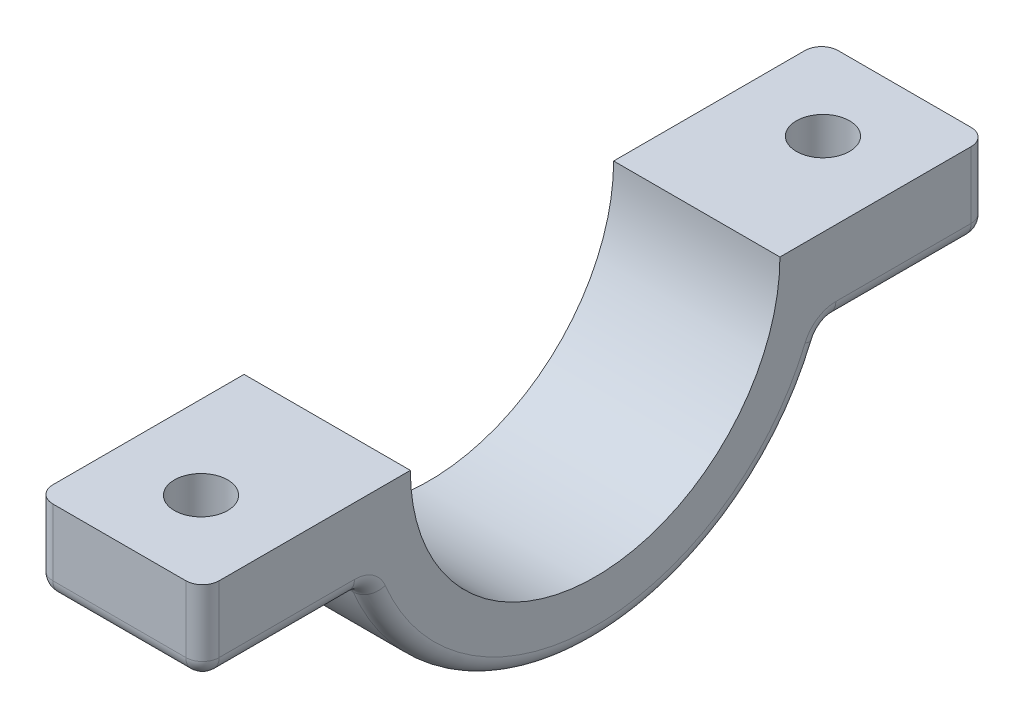
ISO-10303-21;
HEADER;
FILE_DESCRIPTION(('STEP AP214'),'2;1');
FILE_NAME('part.step','',(''),(''),'','','');
FILE_SCHEMA(('AUTOMOTIVE_DESIGN { 1 0 10303 214 1 1 1 1 }'));
ENDSEC;
DATA;
#1=APPLICATION_CONTEXT('core data for automotive mechanical design processes');
#2=APPLICATION_PROTOCOL_DEFINITION('international standard','automotive_design',2000,#1);
#3=PRODUCT_CONTEXT('',#1,'mechanical');
#4=PRODUCT('Part','Part','',(#3));
#5=PRODUCT_RELATED_PRODUCT_CATEGORY('part','',(#4));
#6=PRODUCT_DEFINITION_FORMATION('','',#4);
#7=PRODUCT_DEFINITION_CONTEXT('part definition',#1,'design');
#8=PRODUCT_DEFINITION('design','',#6,#7);
#9=PRODUCT_DEFINITION_SHAPE('','',#8);
#10=(LENGTH_UNIT() NAMED_UNIT(*) SI_UNIT(.MILLI.,.METRE.));
#11=(NAMED_UNIT(*) PLANE_ANGLE_UNIT() SI_UNIT($,.RADIAN.));
#12=(NAMED_UNIT(*) SI_UNIT($,.STERADIAN.) SOLID_ANGLE_UNIT());
#13=UNCERTAINTY_MEASURE_WITH_UNIT(LENGTH_MEASURE(1.E-05),#10,'distance_accuracy_value','');
#14=(GEOMETRIC_REPRESENTATION_CONTEXT(3) GLOBAL_UNCERTAINTY_ASSIGNED_CONTEXT((#13)) GLOBAL_UNIT_ASSIGNED_CONTEXT((#10,
#11,#12)) REPRESENTATION_CONTEXT('',''));
#15=CARTESIAN_POINT('',(0.,0.,0.));
#16=DIRECTION('',(0.,0.,1.));
#17=DIRECTION('',(1.,0.,0.));
#18=AXIS2_PLACEMENT_3D('',#15,#16,#17);
#19=CARTESIAN_POINT('',(10.,0.,0.));
#20=DIRECTION('',(-1.,0.,0.));
#21=DIRECTION('',(0.,0.,1.));
#22=AXIS2_PLACEMENT_3D('',#19,#20,#21);
#23=CYLINDRICAL_SURFACE('',#22,14.6684237820565);
#24=CARTESIAN_POINT('',(0.999999999999999,0.,0.));
#25=DIRECTION('',(1.,0.,0.));
#26=DIRECTION('',(0.,0.,-1.));
#27=AXIS2_PLACEMENT_3D('',#24,#25,#26);
#28=CIRCLE('',#27,14.6684237820565);
#29=CARTESIAN_POINT('',(0.999999999999999,-5.61706422525594,13.5503227171662));
#30=VERTEX_POINT('',#29);
#31=CARTESIAN_POINT('',(0.999999999999999,-5.61706422525594,-13.5503227171662));
#32=VERTEX_POINT('',#31);
#33=EDGE_CURVE('E265',#30,#32,#28,.T.);
#34=ORIENTED_EDGE('',*,*,#33,.T.);
#35=DIRECTION('',(-1.,0.,0.));
#36=VECTOR('',#35,1.);
#37=CARTESIAN_POINT('',(10.,-5.61706422525594,-13.5503227171662));
#38=LINE('',#37,#36);
#39=CARTESIAN_POINT('',(9.,-5.61706422525594,-13.5503227171662));
#40=VERTEX_POINT('',#39);
#41=EDGE_CURVE('E270',#32,#40,#38,.F.);
#42=ORIENTED_EDGE('',*,*,#41,.T.);
#43=CARTESIAN_POINT('',(9.,0.,0.));
#44=DIRECTION('',(1.,0.,0.));
#45=DIRECTION('',(0.,0.,-1.));
#46=AXIS2_PLACEMENT_3D('',#43,#44,#45);
#47=CIRCLE('',#46,14.6684237820565);
#48=CARTESIAN_POINT('',(9.,-5.61706422525594,13.5503227171662));
#49=VERTEX_POINT('',#48);
#50=EDGE_CURVE('E267',#40,#49,#47,.F.);
#51=ORIENTED_EDGE('',*,*,#50,.T.);
#52=DIRECTION('',(-1.,0.,0.));
#53=VECTOR('',#52,1.);
#54=CARTESIAN_POINT('',(10.,-5.61706422525594,13.5503227171662));
#55=LINE('',#54,#53);
#56=EDGE_CURVE('E263',#49,#30,#55,.T.);
#57=ORIENTED_EDGE('',*,*,#56,.T.);
#58=EDGE_LOOP('',(#34,#42,#51,#57));
#59=FACE_BOUND('',#58,.T.);
#60=ADVANCED_FACE('F41',(#59),#23,.T.);
#61=CARTESIAN_POINT('',(10.,-5.,-13.7899476521849));
#62=DIRECTION('',(0.,1.,0.));
#63=DIRECTION('',(0.,0.,1.));
#64=AXIS2_PLACEMENT_3D('',#61,#62,#63);
#65=PLANE('',#64);
#66=DIRECTION('',(0.,0.,-1.));
#67=VECTOR('',#66,1.);
#68=CARTESIAN_POINT('',(0.999999999999999,-5.,-13.7899476521849));
#69=LINE('',#68,#67);
#70=CARTESIAN_POINT('',(0.999999999999999,-5.,-14.4740976856629));
#71=VERTEX_POINT('',#70);
#72=CARTESIAN_POINT('',(0.999999999999999,-5.,-22.6125));
#73=VERTEX_POINT('',#72);
#74=EDGE_CURVE('E240',#71,#73,#69,.T.);
#75=ORIENTED_EDGE('',*,*,#74,.T.);
#76=DIRECTION('',(-1.,0.,0.));
#77=VECTOR('',#76,1.);
#78=CARTESIAN_POINT('',(10.,-5.,-22.6125));
#79=LINE('',#78,#77);
#80=CARTESIAN_POINT('',(9.,-5.,-22.6125));
#81=VERTEX_POINT('',#80);
#82=EDGE_CURVE('E245',#73,#81,#79,.F.);
#83=ORIENTED_EDGE('',*,*,#82,.T.);
#84=DIRECTION('',(0.,0.,-1.));
#85=VECTOR('',#84,1.);
#86=CARTESIAN_POINT('',(9.,-5.,-13.7899476521849));
#87=LINE('',#86,#85);
#88=CARTESIAN_POINT('',(9.,-5.,-14.4740976856629));
#89=VERTEX_POINT('',#88);
#90=EDGE_CURVE('E242',#81,#89,#87,.F.);
#91=ORIENTED_EDGE('',*,*,#90,.T.);
#92=DIRECTION('',(1.,0.,0.));
#93=VECTOR('',#92,1.);
#94=CARTESIAN_POINT('',(0.,-5.,-14.4740976856629));
#95=LINE('',#94,#93);
#96=EDGE_CURVE('E238',#89,#71,#95,.F.);
#97=ORIENTED_EDGE('',*,*,#96,.T.);
#98=EDGE_LOOP('',(#75,#83,#91,#97));
#99=FACE_BOUND('',#98,.T.);
#100=CARTESIAN_POINT('',(5.,-5.,-18.7012238260924));
#101=DIRECTION('',(0.,-1.,0.));
#102=DIRECTION('',(0.,0.,-1.));
#103=AXIS2_PLACEMENT_3D('',#100,#101,#102);
#104=CIRCLE('',#103,1.6);
#105=CARTESIAN_POINT('',(5.,-5.,-20.3012238260924));
#106=VERTEX_POINT('',#105);
#107=EDGE_CURVE('E363',#106,#106,#104,.F.);
#108=ORIENTED_EDGE('',*,*,#107,.T.);
#109=EDGE_LOOP('',(#108));
#110=FACE_BOUND('',#109,.T.);
#111=ADVANCED_FACE('F404',(#99,#110),#65,.F.);
#112=CARTESIAN_POINT('',(10.,0.,-23.6125));
#113=DIRECTION('',(0.,0.,1.));
#114=DIRECTION('',(1.,0.,0.));
#115=AXIS2_PLACEMENT_3D('',#112,#113,#114);
#116=PLANE('',#115);
#117=DIRECTION('',(-1.,0.,0.));
#118=VECTOR('',#117,1.);
#119=CARTESIAN_POINT('',(10.,0.,-23.6125));
#120=LINE('',#119,#118);
#121=CARTESIAN_POINT('',(9.,0.,-23.6125));
#122=VERTEX_POINT('',#121);
#123=CARTESIAN_POINT('',(0.999999999999999,0.,-23.6125));
#124=VERTEX_POINT('',#123);
#125=EDGE_CURVE('E201',#122,#124,#120,.T.);
#126=ORIENTED_EDGE('',*,*,#125,.F.);
#127=DIRECTION('',(0.,1.,0.));
#128=VECTOR('',#127,1.);
#129=CARTESIAN_POINT('',(9.,-5.,-23.6125));
#130=LINE('',#129,#128);
#131=CARTESIAN_POINT('',(9.,-4.,-23.6125));
#132=VERTEX_POINT('',#131);
#133=EDGE_CURVE('E290',#122,#132,#130,.F.);
#134=ORIENTED_EDGE('',*,*,#133,.T.);
#135=DIRECTION('',(-1.,0.,0.));
#136=VECTOR('',#135,1.);
#137=CARTESIAN_POINT('',(10.,-4.,-23.6125));
#138=LINE('',#137,#136);
#139=CARTESIAN_POINT('',(0.999999999999999,-4.,-23.6125));
#140=VERTEX_POINT('',#139);
#141=EDGE_CURVE('E286',#132,#140,#138,.T.);
#142=ORIENTED_EDGE('',*,*,#141,.T.);
#143=DIRECTION('',(0.,1.,0.));
#144=VECTOR('',#143,1.);
#145=CARTESIAN_POINT('',(0.999999999999999,0.,-23.6125));
#146=LINE('',#145,#144);
#147=EDGE_CURVE('E288',#140,#124,#146,.T.);
#148=ORIENTED_EDGE('',*,*,#147,.T.);
#149=EDGE_LOOP('',(#126,#134,#142,#148));
#150=FACE_BOUND('',#149,.T.);
#151=ADVANCED_FACE('F411',(#150),#116,.F.);
#152=CARTESIAN_POINT('',(10.,0.,-11.1125));
#153=DIRECTION('',(0.,-1.,0.));
#154=DIRECTION('',(0.,0.,-1.));
#155=AXIS2_PLACEMENT_3D('',#152,#153,#154);
#156=PLANE('',#155);
#157=CARTESIAN_POINT('',(5.,0.,-18.7012238260924));
#158=DIRECTION('',(0.,-1.,0.));
#159=DIRECTION('',(0.,0.,-1.));
#160=AXIS2_PLACEMENT_3D('',#157,#158,#159);
#161=CIRCLE('',#160,1.6);
#162=CARTESIAN_POINT('',(5.,0.,-20.3012238260924));
#163=VERTEX_POINT('',#162);
#164=EDGE_CURVE('E368',#163,#163,#161,.F.);
#165=ORIENTED_EDGE('',*,*,#164,.F.);
#166=EDGE_LOOP('',(#165));
#167=FACE_BOUND('',#166,.T.);
#168=DIRECTION('',(0.,0.,1.));
#169=VECTOR('',#168,1.);
#170=CARTESIAN_POINT('',(10.,0.,-11.1125));
#171=LINE('',#170,#169);
#172=CARTESIAN_POINT('',(10.,0.,-22.6125));
#173=VERTEX_POINT('',#172);
#174=CARTESIAN_POINT('',(10.,0.,-11.1125));
#175=VERTEX_POINT('',#174);
#176=EDGE_CURVE('E180',#173,#175,#171,.T.);
#177=ORIENTED_EDGE('',*,*,#176,.F.);
#178=CARTESIAN_POINT('',(9.,0.,-22.6125));
#179=DIRECTION('',(0.,-1.,0.));
#180=DIRECTION('',(0.,0.,-1.));
#181=AXIS2_PLACEMENT_3D('',#178,#179,#180);
#182=CIRCLE('',#181,1.);
#183=EDGE_CURVE('E284',#173,#122,#182,.F.);
#184=ORIENTED_EDGE('',*,*,#183,.T.);
#185=ORIENTED_EDGE('',*,*,#125,.T.);
#186=CARTESIAN_POINT('',(0.999999999999999,0.,-22.6125));
#187=DIRECTION('',(0.,-1.,0.));
#188=DIRECTION('',(0.,0.,-1.));
#189=AXIS2_PLACEMENT_3D('',#186,#187,#188);
#190=CIRCLE('',#189,1.);
#191=CARTESIAN_POINT('',(0.,0.,-22.6125));
#192=VERTEX_POINT('',#191);
#193=EDGE_CURVE('E282',#124,#192,#190,.F.);
#194=ORIENTED_EDGE('',*,*,#193,.T.);
#195=DIRECTION('',(0.,0.,1.));
#196=VECTOR('',#195,1.);
#197=CARTESIAN_POINT('',(0.,0.,-11.1125));
#198=LINE('',#197,#196);
#199=CARTESIAN_POINT('',(0.,0.,-11.1125));
#200=VERTEX_POINT('',#199);
#201=EDGE_CURVE('E198',#192,#200,#198,.T.);
#202=ORIENTED_EDGE('',*,*,#201,.T.);
#203=DIRECTION('',(-1.,0.,0.));
#204=VECTOR('',#203,1.);
#205=CARTESIAN_POINT('',(10.,0.,-11.1125));
#206=LINE('',#205,#204);
#207=EDGE_CURVE('E195',#175,#200,#206,.T.);
#208=ORIENTED_EDGE('',*,*,#207,.F.);
#209=EDGE_LOOP('',(#177,#184,#185,#194,#202,#208));
#210=FACE_BOUND('',#209,.T.);
#211=ADVANCED_FACE('F196',(#167,#210),#156,.F.);
#212=CARTESIAN_POINT('',(10.,0.,0.));
#213=DIRECTION('',(-1.,0.,0.));
#214=DIRECTION('',(0.,0.,1.));
#215=AXIS2_PLACEMENT_3D('',#212,#213,#214);
#216=CYLINDRICAL_SURFACE('',#215,11.1125);
#217=CARTESIAN_POINT('',(0.,0.,0.));
#218=DIRECTION('',(-1.,0.,0.));
#219=DIRECTION('',(0.,0.,-1.));
#220=AXIS2_PLACEMENT_3D('',#217,#218,#219);
#221=CIRCLE('',#220,11.1125);
#222=CARTESIAN_POINT('',(0.,0.,11.1125));
#223=VERTEX_POINT('',#222);
#224=EDGE_CURVE('E214',#200,#223,#221,.T.);
#225=ORIENTED_EDGE('',*,*,#224,.T.);
#226=DIRECTION('',(-1.,0.,0.));
#227=VECTOR('',#226,1.);
#228=CARTESIAN_POINT('',(10.,0.,11.1125));
#229=LINE('',#228,#227);
#230=CARTESIAN_POINT('',(10.,0.,11.1125));
#231=VERTEX_POINT('',#230);
#232=EDGE_CURVE('E202',#231,#223,#229,.T.);
#233=ORIENTED_EDGE('',*,*,#232,.F.);
#234=CARTESIAN_POINT('',(10.,0.,0.));
#235=DIRECTION('',(-1.,0.,0.));
#236=DIRECTION('',(0.,0.,-1.));
#237=AXIS2_PLACEMENT_3D('',#234,#235,#236);
#238=CIRCLE('',#237,11.1125);
#239=EDGE_CURVE('E186',#175,#231,#238,.T.);
#240=ORIENTED_EDGE('',*,*,#239,.F.);
#241=ORIENTED_EDGE('',*,*,#207,.T.);
#242=EDGE_LOOP('',(#225,#233,#240,#241));
#243=FACE_BOUND('',#242,.T.);
#244=ADVANCED_FACE('F204',(#243),#216,.F.);
#245=CARTESIAN_POINT('',(10.,0.,23.6125));
#246=DIRECTION('',(0.,-1.,0.));
#247=DIRECTION('',(0.,0.,-1.));
#248=AXIS2_PLACEMENT_3D('',#245,#246,#247);
#249=PLANE('',#248);
#250=CARTESIAN_POINT('',(5.,0.,18.7012238260924));
#251=DIRECTION('',(0.,-1.,0.));
#252=DIRECTION('',(0.,0.,-1.));
#253=AXIS2_PLACEMENT_3D('',#250,#251,#252);
#254=CIRCLE('',#253,1.6);
#255=CARTESIAN_POINT('',(5.,0.,17.1012238260924));
#256=VERTEX_POINT('',#255);
#257=EDGE_CURVE('E215',#256,#256,#254,.T.);
#258=ORIENTED_EDGE('',*,*,#257,.T.);
#259=EDGE_LOOP('',(#258));
#260=FACE_BOUND('',#259,.T.);
#261=DIRECTION('',(0.,0.,1.));
#262=VECTOR('',#261,1.);
#263=CARTESIAN_POINT('',(0.,0.,23.6125));
#264=LINE('',#263,#262);
#265=CARTESIAN_POINT('',(0.,0.,22.6125));
#266=VERTEX_POINT('',#265);
#267=EDGE_CURVE('E192',#223,#266,#264,.T.);
#268=ORIENTED_EDGE('',*,*,#267,.T.);
#269=CARTESIAN_POINT('',(0.999999999999999,0.,22.6125));
#270=DIRECTION('',(0.,-1.,0.));
#271=DIRECTION('',(0.,0.,-1.));
#272=AXIS2_PLACEMENT_3D('',#269,#270,#271);
#273=CIRCLE('',#272,1.);
#274=CARTESIAN_POINT('',(0.999999999999999,0.,23.6125));
#275=VERTEX_POINT('',#274);
#276=EDGE_CURVE('E280',#266,#275,#273,.F.);
#277=ORIENTED_EDGE('',*,*,#276,.T.);
#278=DIRECTION('',(-1.,0.,0.));
#279=VECTOR('',#278,1.);
#280=CARTESIAN_POINT('',(10.,0.,23.6125));
#281=LINE('',#280,#279);
#282=CARTESIAN_POINT('',(9.,0.,23.6125));
#283=VERTEX_POINT('',#282);
#284=EDGE_CURVE('E209',#283,#275,#281,.T.);
#285=ORIENTED_EDGE('',*,*,#284,.F.);
#286=CARTESIAN_POINT('',(9.,0.,22.6125));
#287=DIRECTION('',(0.,-1.,0.));
#288=DIRECTION('',(0.,0.,-1.));
#289=AXIS2_PLACEMENT_3D('',#286,#287,#288);
#290=CIRCLE('',#289,1.);
#291=CARTESIAN_POINT('',(10.,0.,22.6125));
#292=VERTEX_POINT('',#291);
#293=EDGE_CURVE('E278',#283,#292,#290,.F.);
#294=ORIENTED_EDGE('',*,*,#293,.T.);
#295=DIRECTION('',(0.,0.,1.));
#296=VECTOR('',#295,1.);
#297=CARTESIAN_POINT('',(10.,0.,23.6125));
#298=LINE('',#297,#296);
#299=EDGE_CURVE('E207',#231,#292,#298,.T.);
#300=ORIENTED_EDGE('',*,*,#299,.F.);
#301=ORIENTED_EDGE('',*,*,#232,.T.);
#302=EDGE_LOOP('',(#268,#277,#285,#294,#300,#301));
#303=FACE_BOUND('',#302,.T.);
#304=ADVANCED_FACE('F380',(#260,#303),#249,.F.);
#305=CARTESIAN_POINT('',(10.,0.,23.6125));
#306=DIRECTION('',(0.,0.,-1.));
#307=DIRECTION('',(-1.,0.,0.));
#308=AXIS2_PLACEMENT_3D('',#305,#306,#307);
#309=PLANE('',#308);
#310=ORIENTED_EDGE('',*,*,#284,.T.);
#311=DIRECTION('',(0.,-1.,0.));
#312=VECTOR('',#311,1.);
#313=CARTESIAN_POINT('',(0.999999999999999,0.,23.6125));
#314=LINE('',#313,#312);
#315=CARTESIAN_POINT('',(0.999999999999999,-4.,23.6125));
#316=VERTEX_POINT('',#315);
#317=EDGE_CURVE('E276',#275,#316,#314,.T.);
#318=ORIENTED_EDGE('',*,*,#317,.T.);
#319=DIRECTION('',(-1.,0.,0.));
#320=VECTOR('',#319,1.);
#321=CARTESIAN_POINT('',(10.,-4.,23.6125));
#322=LINE('',#321,#320);
#323=CARTESIAN_POINT('',(9.,-4.,23.6125));
#324=VERTEX_POINT('',#323);
#325=EDGE_CURVE('E272',#316,#324,#322,.F.);
#326=ORIENTED_EDGE('',*,*,#325,.T.);
#327=DIRECTION('',(0.,-1.,0.));
#328=VECTOR('',#327,1.);
#329=CARTESIAN_POINT('',(9.,0.,23.6125));
#330=LINE('',#329,#328);
#331=EDGE_CURVE('E274',#324,#283,#330,.F.);
#332=ORIENTED_EDGE('',*,*,#331,.T.);
#333=EDGE_LOOP('',(#310,#318,#326,#332));
#334=FACE_BOUND('',#333,.T.);
#335=ADVANCED_FACE('F393',(#334),#309,.F.);
#336=CARTESIAN_POINT('',(10.,-5.,23.6125));
#337=DIRECTION('',(0.,1.,0.));
#338=DIRECTION('',(0.,0.,1.));
#339=AXIS2_PLACEMENT_3D('',#336,#337,#338);
#340=PLANE('',#339);
#341=DIRECTION('',(0.,0.,-1.));
#342=VECTOR('',#341,1.);
#343=CARTESIAN_POINT('',(0.999999999999999,-5.,23.6125));
#344=LINE('',#343,#342);
#345=CARTESIAN_POINT('',(0.999999999999999,-5.,22.6125));
#346=VERTEX_POINT('',#345);
#347=CARTESIAN_POINT('',(0.999999999999999,-5.,14.4740976856629));
#348=VERTEX_POINT('',#347);
#349=EDGE_CURVE('E292',#346,#348,#344,.T.);
#350=ORIENTED_EDGE('',*,*,#349,.T.);
#351=DIRECTION('',(1.,0.,0.));
#352=VECTOR('',#351,1.);
#353=CARTESIAN_POINT('',(10.,-5.,14.4740976856629));
#354=LINE('',#353,#352);
#355=CARTESIAN_POINT('',(9.,-5.,14.4740976856629));
#356=VERTEX_POINT('',#355);
#357=EDGE_CURVE('E11',#348,#356,#354,.T.);
#358=ORIENTED_EDGE('',*,*,#357,.T.);
#359=DIRECTION('',(0.,0.,-1.));
#360=VECTOR('',#359,1.);
#361=CARTESIAN_POINT('',(9.,-5.,23.6125));
#362=LINE('',#361,#360);
#363=CARTESIAN_POINT('',(9.,-5.,22.6125));
#364=VERTEX_POINT('',#363);
#365=EDGE_CURVE('E50',#356,#364,#362,.F.);
#366=ORIENTED_EDGE('',*,*,#365,.T.);
#367=DIRECTION('',(-1.,0.,0.));
#368=VECTOR('',#367,1.);
#369=CARTESIAN_POINT('',(10.,-5.,22.6125));
#370=LINE('',#369,#368);
#371=EDGE_CURVE('E294',#364,#346,#370,.T.);
#372=ORIENTED_EDGE('',*,*,#371,.T.);
#373=EDGE_LOOP('',(#350,#358,#366,#372));
#374=FACE_BOUND('',#373,.T.);
#375=CARTESIAN_POINT('',(5.,-5.,18.7012238260924));
#376=DIRECTION('',(0.,-1.,0.));
#377=DIRECTION('',(0.,0.,-1.));
#378=AXIS2_PLACEMENT_3D('',#375,#376,#377);
#379=CIRCLE('',#378,1.6);
#380=CARTESIAN_POINT('',(5.,-5.,17.1012238260924));
#381=VERTEX_POINT('',#380);
#382=EDGE_CURVE('E372',#381,#381,#379,.T.);
#383=ORIENTED_EDGE('',*,*,#382,.F.);
#384=EDGE_LOOP('',(#383));
#385=FACE_BOUND('',#384,.T.);
#386=ADVANCED_FACE('F391',(#374,#385),#340,.F.);
#387=CARTESIAN_POINT('',(10.,0.,0.));
#388=DIRECTION('',(1.,0.,0.));
#389=DIRECTION('',(0.,0.,-1.));
#390=AXIS2_PLACEMENT_3D('',#387,#388,#389);
#391=PLANE('',#390);
#392=DIRECTION('',(0.,0.,-1.));
#393=VECTOR('',#392,1.);
#394=CARTESIAN_POINT('',(10.,-4.,-23.6125));
#395=LINE('',#394,#393);
#396=CARTESIAN_POINT('',(10.,-4.,-14.4740976856629));
#397=VERTEX_POINT('',#396);
#398=CARTESIAN_POINT('',(10.,-4.,-22.6125));
#399=VERTEX_POINT('',#398);
#400=EDGE_CURVE('E235',#397,#399,#395,.T.);
#401=ORIENTED_EDGE('',*,*,#400,.T.);
#402=DIRECTION('',(0.,1.,0.));
#403=VECTOR('',#402,1.);
#404=CARTESIAN_POINT('',(10.,0.,-22.6125));
#405=LINE('',#404,#403);
#406=EDGE_CURVE('E189',#399,#173,#405,.T.);
#407=ORIENTED_EDGE('',*,*,#406,.T.);
#408=ORIENTED_EDGE('',*,*,#176,.T.);
#409=ORIENTED_EDGE('',*,*,#239,.T.);
#410=ORIENTED_EDGE('',*,*,#299,.T.);
#411=DIRECTION('',(0.,-1.,0.));
#412=VECTOR('',#411,1.);
#413=CARTESIAN_POINT('',(10.,-5.,22.6125));
#414=LINE('',#413,#412);
#415=CARTESIAN_POINT('',(10.,-4.,22.6125));
#416=VERTEX_POINT('',#415);
#417=EDGE_CURVE('E228',#292,#416,#414,.T.);
#418=ORIENTED_EDGE('',*,*,#417,.T.);
#419=DIRECTION('',(0.,0.,-1.));
#420=VECTOR('',#419,1.);
#421=CARTESIAN_POINT('',(10.,-4.,13.7899476521849));
#422=LINE('',#421,#420);
#423=CARTESIAN_POINT('',(10.,-4.,14.4740976856629));
#424=VERTEX_POINT('',#423);
#425=EDGE_CURVE('E226',#416,#424,#422,.T.);
#426=ORIENTED_EDGE('',*,*,#425,.T.);
#427=CARTESIAN_POINT('',(10.,-6.,14.4740976856629));
#428=DIRECTION('',(1.,0.,0.));
#429=DIRECTION('',(0.,0.,-1.));
#430=AXIS2_PLACEMENT_3D('',#427,#428,#429);
#431=CIRCLE('',#430,2.);
#432=CARTESIAN_POINT('',(10.,-5.23412845051189,12.6265477486694));
#433=VERTEX_POINT('',#432);
#434=EDGE_CURVE('E224',#433,#424,#431,.T.);
#435=ORIENTED_EDGE('',*,*,#434,.F.);
#436=CARTESIAN_POINT('',(10.,0.,0.));
#437=DIRECTION('',(1.,0.,0.));
#438=DIRECTION('',(0.,0.,-1.));
#439=AXIS2_PLACEMENT_3D('',#436,#437,#438);
#440=CIRCLE('',#439,13.6684237820565);
#441=CARTESIAN_POINT('',(10.,-5.23412845051189,-12.6265477486694));
#442=VERTEX_POINT('',#441);
#443=EDGE_CURVE('E230',#433,#442,#440,.T.);
#444=ORIENTED_EDGE('',*,*,#443,.T.);
#445=CARTESIAN_POINT('',(10.,-6.,-14.4740976856629));
#446=DIRECTION('',(1.,0.,0.));
#447=DIRECTION('',(0.,0.,-1.));
#448=AXIS2_PLACEMENT_3D('',#445,#446,#447);
#449=CIRCLE('',#448,2.);
#450=EDGE_CURVE('E232',#397,#442,#449,.T.);
#451=ORIENTED_EDGE('',*,*,#450,.F.);
#452=EDGE_LOOP('',(#401,#407,#408,#409,#410,#418,#426,#435,#444,#451));
#453=FACE_BOUND('',#452,.T.);
#454=ADVANCED_FACE('F183',(#453),#391,.T.);
#455=CARTESIAN_POINT('',(0.,0.,0.));
#456=DIRECTION('',(1.,0.,0.));
#457=DIRECTION('',(0.,0.,-1.));
#458=AXIS2_PLACEMENT_3D('',#455,#456,#457);
#459=PLANE('',#458);
#460=ORIENTED_EDGE('',*,*,#201,.F.);
#461=DIRECTION('',(0.,1.,0.));
#462=VECTOR('',#461,1.);
#463=CARTESIAN_POINT('',(0.,0.,-22.6125));
#464=LINE('',#463,#462);
#465=CARTESIAN_POINT('',(0.,-4.,-22.6125));
#466=VERTEX_POINT('',#465);
#467=EDGE_CURVE('E261',#192,#466,#464,.F.);
#468=ORIENTED_EDGE('',*,*,#467,.T.);
#469=DIRECTION('',(0.,0.,-1.));
#470=VECTOR('',#469,1.);
#471=CARTESIAN_POINT('',(0.,-4.,0.));
#472=LINE('',#471,#470);
#473=CARTESIAN_POINT('',(0.,-4.,-14.4740976856629));
#474=VERTEX_POINT('',#473);
#475=EDGE_CURVE('E259',#466,#474,#472,.F.);
#476=ORIENTED_EDGE('',*,*,#475,.T.);
#477=CARTESIAN_POINT('',(0.,-6.,-14.4740976856629));
#478=DIRECTION('',(1.,0.,0.));
#479=DIRECTION('',(0.,0.,-1.));
#480=AXIS2_PLACEMENT_3D('',#477,#478,#479);
#481=CIRCLE('',#480,2.);
#482=CARTESIAN_POINT('',(0.,-5.23412845051189,-12.6265477486694));
#483=VERTEX_POINT('',#482);
#484=EDGE_CURVE('E256',#483,#474,#481,.F.);
#485=ORIENTED_EDGE('',*,*,#484,.F.);
#486=CARTESIAN_POINT('',(0.,0.,0.));
#487=DIRECTION('',(1.,0.,0.));
#488=DIRECTION('',(0.,0.,-1.));
#489=AXIS2_PLACEMENT_3D('',#486,#487,#488);
#490=CIRCLE('',#489,13.6684237820565);
#491=CARTESIAN_POINT('',(0.,-5.23412845051189,12.6265477486694));
#492=VERTEX_POINT('',#491);
#493=EDGE_CURVE('E254',#483,#492,#490,.F.);
#494=ORIENTED_EDGE('',*,*,#493,.T.);
#495=CARTESIAN_POINT('',(0.,-6.,14.4740976856629));
#496=DIRECTION('',(1.,0.,0.));
#497=DIRECTION('',(0.,0.,-1.));
#498=AXIS2_PLACEMENT_3D('',#495,#496,#497);
#499=CIRCLE('',#498,2.);
#500=CARTESIAN_POINT('',(0.,-4.,14.4740976856629));
#501=VERTEX_POINT('',#500);
#502=EDGE_CURVE('E251',#501,#492,#499,.F.);
#503=ORIENTED_EDGE('',*,*,#502,.F.);
#504=DIRECTION('',(0.,0.,-1.));
#505=VECTOR('',#504,1.);
#506=CARTESIAN_POINT('',(0.,-4.,0.));
#507=LINE('',#506,#505);
#508=CARTESIAN_POINT('',(0.,-4.,22.6125));
#509=VERTEX_POINT('',#508);
#510=EDGE_CURVE('E247',#501,#509,#507,.F.);
#511=ORIENTED_EDGE('',*,*,#510,.T.);
#512=DIRECTION('',(0.,-1.,0.));
#513=VECTOR('',#512,1.);
#514=CARTESIAN_POINT('',(0.,0.,22.6125));
#515=LINE('',#514,#513);
#516=EDGE_CURVE('E249',#509,#266,#515,.F.);
#517=ORIENTED_EDGE('',*,*,#516,.T.);
#518=ORIENTED_EDGE('',*,*,#267,.F.);
#519=ORIENTED_EDGE('',*,*,#224,.F.);
#520=EDGE_LOOP('',(#460,#468,#476,#485,#494,#503,#511,#517,#518,#519));
#521=FACE_BOUND('',#520,.T.);
#522=ADVANCED_FACE('F387',(#521),#459,.F.);
#523=CARTESIAN_POINT('',(5.,0.,18.7012238260924));
#524=DIRECTION('',(0.,-1.,0.));
#525=DIRECTION('',(0.,0.,-1.));
#526=AXIS2_PLACEMENT_3D('',#523,#524,#525);
#527=CYLINDRICAL_SURFACE('',#526,1.6);
#528=ORIENTED_EDGE('',*,*,#257,.F.);
#529=EDGE_LOOP('',(#528));
#530=FACE_BOUND('',#529,.T.);
#531=ORIENTED_EDGE('',*,*,#382,.T.);
#532=EDGE_LOOP('',(#531));
#533=FACE_BOUND('',#532,.T.);
#534=ADVANCED_FACE('F383',(#530,#533),#527,.F.);
#535=CARTESIAN_POINT('',(5.,0.,-18.7012238260924));
#536=DIRECTION('',(0.,-1.,0.));
#537=DIRECTION('',(0.,0.,-1.));
#538=AXIS2_PLACEMENT_3D('',#535,#536,#537);
#539=CYLINDRICAL_SURFACE('',#538,1.6);
#540=ORIENTED_EDGE('',*,*,#164,.T.);
#541=EDGE_LOOP('',(#540));
#542=FACE_BOUND('',#541,.T.);
#543=ORIENTED_EDGE('',*,*,#107,.F.);
#544=EDGE_LOOP('',(#543));
#545=FACE_BOUND('',#544,.T.);
#546=ADVANCED_FACE('F386',(#542,#545),#539,.F.);
#547=CARTESIAN_POINT('',(0.999999999999999,0.,22.6125));
#548=DIRECTION('',(0.,-1.,0.));
#549=DIRECTION('',(0.,0.,-1.));
#550=AXIS2_PLACEMENT_3D('',#547,#548,#549);
#551=CYLINDRICAL_SURFACE('',#550,1.);
#552=CARTESIAN_POINT('',(0.999999999999999,-4.,22.6125));
#553=DIRECTION('',(0.,-1.,0.));
#554=DIRECTION('',(0.,0.,-1.));
#555=AXIS2_PLACEMENT_3D('',#552,#553,#554);
#556=CIRCLE('',#555,1.);
#557=EDGE_CURVE('E45',#316,#509,#556,.T.);
#558=ORIENTED_EDGE('',*,*,#557,.F.);
#559=ORIENTED_EDGE('',*,*,#317,.F.);
#560=ORIENTED_EDGE('',*,*,#276,.F.);
#561=ORIENTED_EDGE('',*,*,#516,.F.);
#562=EDGE_LOOP('',(#558,#559,#560,#561));
#563=FACE_BOUND('',#562,.T.);
#564=ADVANCED_FACE('F43',(#563),#551,.T.);
#565=CARTESIAN_POINT('',(1.,-4.,22.6125));
#566=DIRECTION('',(-1.,0.,0.));
#567=DIRECTION('',(0.,0.,1.));
#568=AXIS2_PLACEMENT_3D('',#565,#566,#567);
#569=SPHERICAL_SURFACE('',#568,1.);
#570=CARTESIAN_POINT('',(0.999999999999999,-4.,22.6125));
#571=DIRECTION('',(-1.,0.,0.));
#572=DIRECTION('',(0.,0.,1.));
#573=AXIS2_PLACEMENT_3D('',#570,#571,#572);
#574=CIRCLE('',#573,1.);
#575=EDGE_CURVE('E354',#316,#346,#574,.F.);
#576=ORIENTED_EDGE('',*,*,#575,.F.);
#577=ORIENTED_EDGE('',*,*,#557,.T.);
#578=CARTESIAN_POINT('',(1.,-4.,22.6125));
#579=DIRECTION('',(0.,0.,1.));
#580=DIRECTION('',(1.,0.,0.));
#581=AXIS2_PLACEMENT_3D('',#578,#579,#580);
#582=CIRCLE('',#581,1.);
#583=EDGE_CURVE('E356',#346,#509,#582,.F.);
#584=ORIENTED_EDGE('',*,*,#583,.F.);
#585=EDGE_LOOP('',(#576,#577,#584));
#586=FACE_BOUND('',#585,.T.);
#587=ADVANCED_FACE('F493',(#586),#569,.T.);
#588=CARTESIAN_POINT('',(0.999999999999999,-4.,23.6125));
#589=DIRECTION('',(0.,0.,-1.));
#590=DIRECTION('',(0.,1.,0.));
#591=AXIS2_PLACEMENT_3D('',#588,#589,#590);
#592=CYLINDRICAL_SURFACE('',#591,1.);
#593=ORIENTED_EDGE('',*,*,#583,.T.);
#594=ORIENTED_EDGE('',*,*,#510,.F.);
#595=CARTESIAN_POINT('',(0.999999999999999,-4.,14.4740976856629));
#596=DIRECTION('',(0.,0.,-1.));
#597=DIRECTION('',(-1.,0.,0.));
#598=AXIS2_PLACEMENT_3D('',#595,#596,#597);
#599=CIRCLE('',#598,1.);
#600=EDGE_CURVE('E351',#348,#501,#599,.T.);
#601=ORIENTED_EDGE('',*,*,#600,.F.);
#602=ORIENTED_EDGE('',*,*,#349,.F.);
#603=EDGE_LOOP('',(#593,#594,#601,#602));
#604=FACE_BOUND('',#603,.T.);
#605=ADVANCED_FACE('F490',(#604),#592,.T.);
#606=CARTESIAN_POINT('',(10.,-4.,22.6125));
#607=DIRECTION('',(-1.,0.,0.));
#608=DIRECTION('',(0.,0.,1.));
#609=AXIS2_PLACEMENT_3D('',#606,#607,#608);
#610=CYLINDRICAL_SURFACE('',#609,1.);
#611=ORIENTED_EDGE('',*,*,#575,.T.);
#612=ORIENTED_EDGE('',*,*,#371,.F.);
#613=CARTESIAN_POINT('',(9.,-4.,22.6125));
#614=DIRECTION('',(1.,0.,0.));
#615=DIRECTION('',(0.,0.,-1.));
#616=AXIS2_PLACEMENT_3D('',#613,#614,#615);
#617=CIRCLE('',#616,1.);
#618=EDGE_CURVE('E348',#324,#364,#617,.T.);
#619=ORIENTED_EDGE('',*,*,#618,.F.);
#620=ORIENTED_EDGE('',*,*,#325,.F.);
#621=EDGE_LOOP('',(#611,#612,#619,#620));
#622=FACE_BOUND('',#621,.T.);
#623=ADVANCED_FACE('F486',(#622),#610,.T.);
#624=CARTESIAN_POINT('',(9.,0.,22.6125));
#625=DIRECTION('',(0.,1.,0.));
#626=DIRECTION('',(0.,0.,1.));
#627=AXIS2_PLACEMENT_3D('',#624,#625,#626);
#628=CYLINDRICAL_SURFACE('',#627,1.);
#629=ORIENTED_EDGE('',*,*,#293,.F.);
#630=ORIENTED_EDGE('',*,*,#331,.F.);
#631=CARTESIAN_POINT('',(9.,-4.,22.6125));
#632=DIRECTION('',(0.,-1.,0.));
#633=DIRECTION('',(0.,0.,-1.));
#634=AXIS2_PLACEMENT_3D('',#631,#632,#633);
#635=CIRCLE('',#634,1.);
#636=EDGE_CURVE('E345',#416,#324,#635,.T.);
#637=ORIENTED_EDGE('',*,*,#636,.F.);
#638=ORIENTED_EDGE('',*,*,#417,.F.);
#639=EDGE_LOOP('',(#629,#630,#637,#638));
#640=FACE_BOUND('',#639,.T.);
#641=ADVANCED_FACE('F482',(#640),#628,.T.);
#642=CARTESIAN_POINT('',(0.999999999999999,-6.,14.4740976856629));
#643=DIRECTION('',(1.,0.,0.));
#644=DIRECTION('',(0.,0.,-1.));
#645=AXIS2_PLACEMENT_3D('',#642,#643,#644);
#646=TOROIDAL_SURFACE('',#645,2.,1.);
#647=ORIENTED_EDGE('',*,*,#600,.T.);
#648=ORIENTED_EDGE('',*,*,#502,.T.);
#649=CARTESIAN_POINT('',(1.,-5.23412845051189,12.6265477486694));
#650=DIRECTION('',(0.,0.923774968496748,0.382935774744057));
#651=DIRECTION('',(0.,-0.382935774744057,0.923774968496749));
#652=AXIS2_PLACEMENT_3D('',#649,#650,#651);
#653=CIRCLE('',#652,1.);
#654=EDGE_CURVE('E342',#30,#492,#653,.F.);
#655=ORIENTED_EDGE('',*,*,#654,.F.);
#656=CARTESIAN_POINT('',(0.999999999999999,-6.,14.4740976856629));
#657=DIRECTION('',(1.,0.,0.));
#658=DIRECTION('',(0.,0.,-1.));
#659=AXIS2_PLACEMENT_3D('',#656,#657,#658);
#660=CIRCLE('',#659,1.);
#661=EDGE_CURVE('E339',#348,#30,#660,.F.);
#662=ORIENTED_EDGE('',*,*,#661,.F.);
#663=EDGE_LOOP('',(#647,#648,#655,#662));
#664=FACE_BOUND('',#663,.T.);
#665=ADVANCED_FACE('F478',(#664),#646,.T.);
#666=CARTESIAN_POINT('',(9.,-4.,22.6125));
#667=DIRECTION('',(0.,0.,1.));
#668=DIRECTION('',(1.,0.,0.));
#669=AXIS2_PLACEMENT_3D('',#666,#667,#668);
#670=SPHERICAL_SURFACE('',#669,1.);
#671=ORIENTED_EDGE('',*,*,#636,.T.);
#672=ORIENTED_EDGE('',*,*,#618,.T.);
#673=CARTESIAN_POINT('',(9.,-4.,22.6125));
#674=DIRECTION('',(0.,0.,1.));
#675=DIRECTION('',(1.,0.,0.));
#676=AXIS2_PLACEMENT_3D('',#673,#674,#675);
#677=CIRCLE('',#676,1.);
#678=EDGE_CURVE('E336',#416,#364,#677,.F.);
#679=ORIENTED_EDGE('',*,*,#678,.F.);
#680=EDGE_LOOP('',(#671,#672,#679));
#681=FACE_BOUND('',#680,.T.);
#682=ADVANCED_FACE('F474',(#681),#670,.T.);
#683=CARTESIAN_POINT('',(0.999999999999999,0.,0.));
#684=DIRECTION('',(1.,0.,0.));
#685=DIRECTION('',(0.,0.,-1.));
#686=AXIS2_PLACEMENT_3D('',#683,#684,#685);
#687=TOROIDAL_SURFACE('',#686,13.6684237820565,1.);
#688=ORIENTED_EDGE('',*,*,#654,.T.);
#689=ORIENTED_EDGE('',*,*,#493,.F.);
#690=CARTESIAN_POINT('',(0.999999999999999,-5.23412845051189,-12.6265477486694));
#691=DIRECTION('',(0.,0.923774968496749,-0.382935774744057));
#692=DIRECTION('',(0.,0.382935774744057,0.923774968496749));
#693=AXIS2_PLACEMENT_3D('',#690,#691,#692);
#694=CIRCLE('',#693,1.);
#695=EDGE_CURVE('E330',#32,#483,#694,.T.);
#696=ORIENTED_EDGE('',*,*,#695,.F.);
#697=ORIENTED_EDGE('',*,*,#33,.F.);
#698=EDGE_LOOP('',(#688,#689,#696,#697));
#699=FACE_BOUND('',#698,.T.);
#700=ADVANCED_FACE('F470',(#699),#687,.T.);
#701=CARTESIAN_POINT('',(10.,-6.,14.4740976856629));
#702=DIRECTION('',(-1.,0.,0.));
#703=DIRECTION('',(0.,0.,1.));
#704=AXIS2_PLACEMENT_3D('',#701,#702,#703);
#705=CYLINDRICAL_SURFACE('',#704,1.);
#706=ORIENTED_EDGE('',*,*,#661,.T.);
#707=ORIENTED_EDGE('',*,*,#56,.F.);
#708=CARTESIAN_POINT('',(9.,-6.,14.4740976856629));
#709=DIRECTION('',(1.,0.,0.));
#710=DIRECTION('',(0.,0.,-1.));
#711=AXIS2_PLACEMENT_3D('',#708,#709,#710);
#712=CIRCLE('',#711,1.);
#713=EDGE_CURVE('E328',#356,#49,#712,.F.);
#714=ORIENTED_EDGE('',*,*,#713,.F.);
#715=ORIENTED_EDGE('',*,*,#357,.F.);
#716=EDGE_LOOP('',(#706,#707,#714,#715));
#717=FACE_BOUND('',#716,.T.);
#718=ADVANCED_FACE('F466',(#717),#705,.F.);
#719=CARTESIAN_POINT('',(9.,-4.,0.));
#720=DIRECTION('',(0.,0.,1.));
#721=DIRECTION('',(0.,-1.,0.));
#722=AXIS2_PLACEMENT_3D('',#719,#720,#721);
#723=CYLINDRICAL_SURFACE('',#722,1.);
#724=ORIENTED_EDGE('',*,*,#678,.T.);
#725=ORIENTED_EDGE('',*,*,#365,.F.);
#726=CARTESIAN_POINT('',(9.,-4.,14.4740976856629));
#727=DIRECTION('',(0.,0.,-1.));
#728=DIRECTION('',(-1.,0.,0.));
#729=AXIS2_PLACEMENT_3D('',#726,#727,#728);
#730=CIRCLE('',#729,1.);
#731=EDGE_CURVE('E58',#424,#356,#730,.T.);
#732=ORIENTED_EDGE('',*,*,#731,.F.);
#733=ORIENTED_EDGE('',*,*,#425,.F.);
#734=EDGE_LOOP('',(#724,#725,#732,#733));
#735=FACE_BOUND('',#734,.T.);
#736=ADVANCED_FACE('F462',(#735),#723,.T.);
#737=CARTESIAN_POINT('',(0.999999999999999,0.,-22.6125));
#738=DIRECTION('',(0.,1.,0.));
#739=DIRECTION('',(0.,0.,1.));
#740=AXIS2_PLACEMENT_3D('',#737,#738,#739);
#741=CYLINDRICAL_SURFACE('',#740,1.);
#742=ORIENTED_EDGE('',*,*,#193,.F.);
#743=ORIENTED_EDGE('',*,*,#147,.F.);
#744=CARTESIAN_POINT('',(1.,-4.,-22.6125));
#745=DIRECTION('',(0.,-1.,0.));
#746=DIRECTION('',(0.,0.,-1.));
#747=AXIS2_PLACEMENT_3D('',#744,#745,#746);
#748=CIRCLE('',#747,1.);
#749=EDGE_CURVE('E324',#466,#140,#748,.T.);
#750=ORIENTED_EDGE('',*,*,#749,.F.);
#751=ORIENTED_EDGE('',*,*,#467,.F.);
#752=EDGE_LOOP('',(#742,#743,#750,#751));
#753=FACE_BOUND('',#752,.T.);
#754=ADVANCED_FACE('F458',(#753),#741,.T.);
#755=CARTESIAN_POINT('',(0.999999999999999,-4.,-13.7899476521849));
#756=DIRECTION('',(0.,0.,-1.));
#757=DIRECTION('',(0.,1.,0.));
#758=AXIS2_PLACEMENT_3D('',#755,#756,#757);
#759=CYLINDRICAL_SURFACE('',#758,1.);
#760=CARTESIAN_POINT('',(1.,-4.,-14.4740976856629));
#761=DIRECTION('',(0.,0.,1.));
#762=DIRECTION('',(1.,0.,0.));
#763=AXIS2_PLACEMENT_3D('',#760,#761,#762);
#764=CIRCLE('',#763,1.);
#765=EDGE_CURVE('E333',#474,#71,#764,.T.);
#766=ORIENTED_EDGE('',*,*,#765,.F.);
#767=ORIENTED_EDGE('',*,*,#475,.F.);
#768=CARTESIAN_POINT('',(0.999999999999999,-4.,-22.6125));
#769=DIRECTION('',(0.,0.,-1.));
#770=DIRECTION('',(-1.,0.,0.));
#771=AXIS2_PLACEMENT_3D('',#768,#769,#770);
#772=CIRCLE('',#771,1.);
#773=EDGE_CURVE('E321',#73,#466,#772,.T.);
#774=ORIENTED_EDGE('',*,*,#773,.F.);
#775=ORIENTED_EDGE('',*,*,#74,.F.);
#776=EDGE_LOOP('',(#766,#767,#774,#775));
#777=FACE_BOUND('',#776,.T.);
#778=ADVANCED_FACE('F454',(#777),#759,.T.);
#779=CARTESIAN_POINT('',(0.999999999999999,-6.,-14.4740976856629));
#780=DIRECTION('',(1.,0.,0.));
#781=DIRECTION('',(0.,0.,-1.));
#782=AXIS2_PLACEMENT_3D('',#779,#780,#781);
#783=TOROIDAL_SURFACE('',#782,2.,1.);
#784=ORIENTED_EDGE('',*,*,#484,.T.);
#785=ORIENTED_EDGE('',*,*,#765,.T.);
#786=CARTESIAN_POINT('',(0.999999999999999,-6.,-14.4740976856629));
#787=DIRECTION('',(1.,0.,0.));
#788=DIRECTION('',(0.,0.,-1.));
#789=AXIS2_PLACEMENT_3D('',#786,#787,#788);
#790=CIRCLE('',#789,1.);
#791=EDGE_CURVE('E318',#32,#71,#790,.F.);
#792=ORIENTED_EDGE('',*,*,#791,.F.);
#793=ORIENTED_EDGE('',*,*,#695,.T.);
#794=EDGE_LOOP('',(#784,#785,#792,#793));
#795=FACE_BOUND('',#794,.T.);
#796=ADVANCED_FACE('F451',(#795),#783,.T.);
#797=CARTESIAN_POINT('',(9.,-6.,14.4740976856629));
#798=DIRECTION('',(1.,0.,0.));
#799=DIRECTION('',(0.,0.,-1.));
#800=AXIS2_PLACEMENT_3D('',#797,#798,#799);
#801=TOROIDAL_SURFACE('',#800,2.,1.);
#802=ORIENTED_EDGE('',*,*,#731,.T.);
#803=ORIENTED_EDGE('',*,*,#713,.T.);
#804=CARTESIAN_POINT('',(9.,-5.23412845051189,12.6265477486694));
#805=DIRECTION('',(0.,0.923774968496749,0.382935774744057));
#806=DIRECTION('',(0.,-0.382935774744057,0.923774968496749));
#807=AXIS2_PLACEMENT_3D('',#804,#805,#806);
#808=CIRCLE('',#807,1.);
#809=EDGE_CURVE('E316',#433,#49,#808,.F.);
#810=ORIENTED_EDGE('',*,*,#809,.F.);
#811=ORIENTED_EDGE('',*,*,#434,.T.);
#812=EDGE_LOOP('',(#802,#803,#810,#811));
#813=FACE_BOUND('',#812,.T.);
#814=ADVANCED_FACE('F447',(#813),#801,.T.);
#815=CARTESIAN_POINT('',(1.,-4.,-22.6125));
#816=DIRECTION('',(-1.,0.,0.));
#817=DIRECTION('',(0.,0.,1.));
#818=AXIS2_PLACEMENT_3D('',#815,#816,#817);
#819=SPHERICAL_SURFACE('',#818,1.);
#820=ORIENTED_EDGE('',*,*,#773,.T.);
#821=ORIENTED_EDGE('',*,*,#749,.T.);
#822=CARTESIAN_POINT('',(0.999999999999999,-4.,-22.6125));
#823=DIRECTION('',(-1.,0.,0.));
#824=DIRECTION('',(0.,0.,1.));
#825=AXIS2_PLACEMENT_3D('',#822,#823,#824);
#826=CIRCLE('',#825,1.);
#827=EDGE_CURVE('E313',#73,#140,#826,.F.);
#828=ORIENTED_EDGE('',*,*,#827,.F.);
#829=EDGE_LOOP('',(#820,#821,#828));
#830=FACE_BOUND('',#829,.T.);
#831=ADVANCED_FACE('F443',(#830),#819,.T.);
#832=CARTESIAN_POINT('',(10.,-6.,-14.4740976856629));
#833=DIRECTION('',(-1.,0.,0.));
#834=DIRECTION('',(0.,0.,1.));
#835=AXIS2_PLACEMENT_3D('',#832,#833,#834);
#836=CYLINDRICAL_SURFACE('',#835,1.);
#837=ORIENTED_EDGE('',*,*,#791,.T.);
#838=ORIENTED_EDGE('',*,*,#96,.F.);
#839=CARTESIAN_POINT('',(9.,-6.,-14.4740976856629));
#840=DIRECTION('',(1.,0.,0.));
#841=DIRECTION('',(0.,0.,-1.));
#842=AXIS2_PLACEMENT_3D('',#839,#840,#841);
#843=CIRCLE('',#842,1.);
#844=EDGE_CURVE('E310',#40,#89,#843,.F.);
#845=ORIENTED_EDGE('',*,*,#844,.F.);
#846=ORIENTED_EDGE('',*,*,#41,.F.);
#847=EDGE_LOOP('',(#837,#838,#845,#846));
#848=FACE_BOUND('',#847,.T.);
#849=ADVANCED_FACE('F439',(#848),#836,.F.);
#850=CARTESIAN_POINT('',(9.,0.,0.));
#851=DIRECTION('',(1.,0.,0.));
#852=DIRECTION('',(0.,0.,-1.));
#853=AXIS2_PLACEMENT_3D('',#850,#851,#852);
#854=TOROIDAL_SURFACE('',#853,13.6684237820565,1.);
#855=ORIENTED_EDGE('',*,*,#809,.T.);
#856=ORIENTED_EDGE('',*,*,#50,.F.);
#857=CARTESIAN_POINT('',(9.,-5.23412845051189,-12.6265477486694));
#858=DIRECTION('',(0.,0.923774968496749,-0.382935774744057));
#859=DIRECTION('',(0.,0.382935774744057,0.923774968496749));
#860=AXIS2_PLACEMENT_3D('',#857,#858,#859);
#861=CIRCLE('',#860,1.);
#862=EDGE_CURVE('E307',#442,#40,#861,.T.);
#863=ORIENTED_EDGE('',*,*,#862,.F.);
#864=ORIENTED_EDGE('',*,*,#443,.F.);
#865=EDGE_LOOP('',(#855,#856,#863,#864));
#866=FACE_BOUND('',#865,.T.);
#867=ADVANCED_FACE('F435',(#866),#854,.T.);
#868=CARTESIAN_POINT('',(9.,0.,-22.6125));
#869=DIRECTION('',(0.,-1.,0.));
#870=DIRECTION('',(0.,0.,-1.));
#871=AXIS2_PLACEMENT_3D('',#868,#869,#870);
#872=CYLINDRICAL_SURFACE('',#871,1.);
#873=ORIENTED_EDGE('',*,*,#183,.F.);
#874=ORIENTED_EDGE('',*,*,#406,.F.);
#875=CARTESIAN_POINT('',(9.,-4.,-22.6125));
#876=DIRECTION('',(0.,-1.,0.));
#877=DIRECTION('',(0.,0.,-1.));
#878=AXIS2_PLACEMENT_3D('',#875,#876,#877);
#879=CIRCLE('',#878,1.);
#880=EDGE_CURVE('E304',#132,#399,#879,.T.);
#881=ORIENTED_EDGE('',*,*,#880,.F.);
#882=ORIENTED_EDGE('',*,*,#133,.F.);
#883=EDGE_LOOP('',(#873,#874,#881,#882));
#884=FACE_BOUND('',#883,.T.);
#885=ADVANCED_FACE('F431',(#884),#872,.T.);
#886=CARTESIAN_POINT('',(10.,-4.,-22.6125));
#887=DIRECTION('',(-1.,0.,0.));
#888=DIRECTION('',(0.,0.,1.));
#889=AXIS2_PLACEMENT_3D('',#886,#887,#888);
#890=CYLINDRICAL_SURFACE('',#889,1.);
#891=ORIENTED_EDGE('',*,*,#827,.T.);
#892=ORIENTED_EDGE('',*,*,#141,.F.);
#893=CARTESIAN_POINT('',(9.,-4.,-22.6125));
#894=DIRECTION('',(1.,0.,0.));
#895=DIRECTION('',(0.,0.,-1.));
#896=AXIS2_PLACEMENT_3D('',#893,#894,#895);
#897=CIRCLE('',#896,1.);
#898=EDGE_CURVE('E301',#81,#132,#897,.T.);
#899=ORIENTED_EDGE('',*,*,#898,.F.);
#900=ORIENTED_EDGE('',*,*,#82,.F.);
#901=EDGE_LOOP('',(#891,#892,#899,#900));
#902=FACE_BOUND('',#901,.T.);
#903=ADVANCED_FACE('F427',(#902),#890,.T.);
#904=CARTESIAN_POINT('',(9.,-6.,-14.4740976856629));
#905=DIRECTION('',(1.,0.,0.));
#906=DIRECTION('',(0.,0.,-1.));
#907=AXIS2_PLACEMENT_3D('',#904,#905,#906);
#908=TOROIDAL_SURFACE('',#907,2.,1.);
#909=ORIENTED_EDGE('',*,*,#862,.T.);
#910=ORIENTED_EDGE('',*,*,#844,.T.);
#911=CARTESIAN_POINT('',(9.,-4.,-14.4740976856629));
#912=DIRECTION('',(0.,0.,1.));
#913=DIRECTION('',(1.,0.,0.));
#914=AXIS2_PLACEMENT_3D('',#911,#912,#913);
#915=CIRCLE('',#914,1.);
#916=EDGE_CURVE('E299',#397,#89,#915,.F.);
#917=ORIENTED_EDGE('',*,*,#916,.F.);
#918=ORIENTED_EDGE('',*,*,#450,.T.);
#919=EDGE_LOOP('',(#909,#910,#917,#918));
#920=FACE_BOUND('',#919,.T.);
#921=ADVANCED_FACE('F423',(#920),#908,.T.);
#922=CARTESIAN_POINT('',(9.,-4.,-22.6125));
#923=DIRECTION('',(0.,0.,-1.));
#924=DIRECTION('',(-1.,0.,0.));
#925=AXIS2_PLACEMENT_3D('',#922,#923,#924);
#926=SPHERICAL_SURFACE('',#925,1.);
#927=ORIENTED_EDGE('',*,*,#898,.T.);
#928=ORIENTED_EDGE('',*,*,#880,.T.);
#929=CARTESIAN_POINT('',(9.,-4.,-22.6125));
#930=DIRECTION('',(0.,0.,-1.));
#931=DIRECTION('',(-1.,0.,0.));
#932=AXIS2_PLACEMENT_3D('',#929,#930,#931);
#933=CIRCLE('',#932,1.);
#934=EDGE_CURVE('E297',#81,#399,#933,.F.);
#935=ORIENTED_EDGE('',*,*,#934,.F.);
#936=EDGE_LOOP('',(#927,#928,#935));
#937=FACE_BOUND('',#936,.T.);
#938=ADVANCED_FACE('F419',(#937),#926,.T.);
#939=CARTESIAN_POINT('',(9.,-4.,0.));
#940=DIRECTION('',(0.,0.,1.));
#941=DIRECTION('',(0.,-1.,0.));
#942=AXIS2_PLACEMENT_3D('',#939,#940,#941);
#943=CYLINDRICAL_SURFACE('',#942,1.);
#944=ORIENTED_EDGE('',*,*,#916,.T.);
#945=ORIENTED_EDGE('',*,*,#90,.F.);
#946=ORIENTED_EDGE('',*,*,#934,.T.);
#947=ORIENTED_EDGE('',*,*,#400,.F.);
#948=EDGE_LOOP('',(#944,#945,#946,#947));
#949=FACE_BOUND('',#948,.T.);
#950=ADVANCED_FACE('F416',(#949),#943,.T.);
#951=CLOSED_SHELL('',(#60,#111,#151,#211,#244,#304,#335,#386,#454,#522,#534,#546,#564,#587,#605,
#623,#641,#665,#682,#700,#718,#736,#754,#778,#796,#814,#831,#849,#867,#885,#903,#921,#938,#950));
#952=MANIFOLD_SOLID_BREP('B2',#951);
#953=ADVANCED_BREP_SHAPE_REPRESENTATION('',(#18,#952),#14);
#954=SHAPE_DEFINITION_REPRESENTATION(#9,#953);
ENDSEC;
END-ISO-10303-21;
